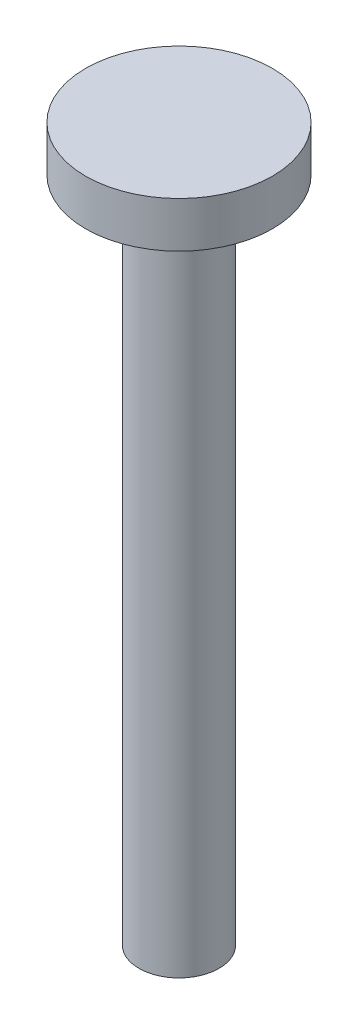
ISO-10303-21;
HEADER;
FILE_DESCRIPTION(('STEP AP214'),'2;1');
FILE_NAME('part.step','',(''),(''),'','','');
FILE_SCHEMA(('AUTOMOTIVE_DESIGN { 1 0 10303 214 1 1 1 1 }'));
ENDSEC;
DATA;
#1=APPLICATION_CONTEXT('core data for automotive mechanical design processes');
#2=APPLICATION_PROTOCOL_DEFINITION('international standard','automotive_design',2000,#1);
#3=PRODUCT_CONTEXT('',#1,'mechanical');
#4=PRODUCT('Part','Part','',(#3));
#5=PRODUCT_RELATED_PRODUCT_CATEGORY('part','',(#4));
#6=PRODUCT_DEFINITION_FORMATION('','',#4);
#7=PRODUCT_DEFINITION_CONTEXT('part definition',#1,'design');
#8=PRODUCT_DEFINITION('design','',#6,#7);
#9=PRODUCT_DEFINITION_SHAPE('','',#8);
#10=(LENGTH_UNIT() NAMED_UNIT(*) SI_UNIT(.MILLI.,.METRE.));
#11=(NAMED_UNIT(*) PLANE_ANGLE_UNIT() SI_UNIT($,.RADIAN.));
#12=(NAMED_UNIT(*) SI_UNIT($,.STERADIAN.) SOLID_ANGLE_UNIT());
#13=UNCERTAINTY_MEASURE_WITH_UNIT(LENGTH_MEASURE(1.E-05),#10,'distance_accuracy_value','');
#14=(GEOMETRIC_REPRESENTATION_CONTEXT(3) GLOBAL_UNCERTAINTY_ASSIGNED_CONTEXT((#13)) GLOBAL_UNIT_ASSIGNED_CONTEXT((#10,
#11,#12)) REPRESENTATION_CONTEXT('',''));
#15=CARTESIAN_POINT('',(0.,0.,0.));
#16=DIRECTION('',(0.,0.,1.));
#17=DIRECTION('',(1.,0.,0.));
#18=AXIS2_PLACEMENT_3D('',#15,#16,#17);
#19=CARTESIAN_POINT('',(0.,1.71,0.));
#20=DIRECTION('',(0.,-1.,0.));
#21=DIRECTION('',(0.,0.,-1.));
#22=AXIS2_PLACEMENT_3D('',#19,#20,#21);
#23=CYLINDRICAL_SURFACE('',#22,3.5);
#24=CARTESIAN_POINT('',(0.,1.71,0.));
#25=DIRECTION('',(0.,1.,0.));
#26=DIRECTION('',(0.,0.,1.));
#27=AXIS2_PLACEMENT_3D('',#24,#25,#26);
#28=CIRCLE('',#27,3.5);
#29=CARTESIAN_POINT('',(0.,1.71,3.5));
#30=VERTEX_POINT('',#29);
#31=EDGE_CURVE('E40',#30,#30,#28,.T.);
#32=ORIENTED_EDGE('',*,*,#31,.F.);
#33=EDGE_LOOP('',(#32));
#34=FACE_BOUND('',#33,.T.);
#35=CARTESIAN_POINT('',(0.,0.,0.));
#36=DIRECTION('',(0.,1.,0.));
#37=DIRECTION('',(0.,0.,1.));
#38=AXIS2_PLACEMENT_3D('',#35,#36,#37);
#39=CIRCLE('',#38,3.5);
#40=CARTESIAN_POINT('',(0.,0.,3.5));
#41=VERTEX_POINT('',#40);
#42=EDGE_CURVE('E36',#41,#41,#39,.T.);
#43=ORIENTED_EDGE('',*,*,#42,.T.);
#44=EDGE_LOOP('',(#43));
#45=FACE_BOUND('',#44,.T.);
#46=ADVANCED_FACE('F33',(#34,#45),#23,.T.);
#47=CARTESIAN_POINT('',(0.,1.71,0.));
#48=DIRECTION('',(0.,1.,0.));
#49=DIRECTION('',(0.,0.,1.));
#50=AXIS2_PLACEMENT_3D('',#47,#48,#49);
#51=PLANE('',#50);
#52=ORIENTED_EDGE('',*,*,#31,.T.);
#53=EDGE_LOOP('',(#52));
#54=FACE_BOUND('',#53,.T.);
#55=ADVANCED_FACE('F57',(#54),#51,.T.);
#56=CARTESIAN_POINT('',(0.,0.,0.));
#57=DIRECTION('',(0.,1.,0.));
#58=DIRECTION('',(0.,0.,1.));
#59=AXIS2_PLACEMENT_3D('',#56,#57,#58);
#60=PLANE('',#59);
#61=CARTESIAN_POINT('',(0.,0.,0.));
#62=DIRECTION('',(0.,-1.,0.));
#63=DIRECTION('',(0.,0.,-1.));
#64=AXIS2_PLACEMENT_3D('',#61,#62,#63);
#65=CIRCLE('',#64,1.5);
#66=CARTESIAN_POINT('',(0.,0.,-1.5));
#67=VERTEX_POINT('',#66);
#68=EDGE_CURVE('E10',#67,#67,#65,.T.);
#69=ORIENTED_EDGE('',*,*,#68,.F.);
#70=EDGE_LOOP('',(#69));
#71=FACE_BOUND('',#70,.T.);
#72=ORIENTED_EDGE('',*,*,#42,.F.);
#73=EDGE_LOOP('',(#72));
#74=FACE_BOUND('',#73,.T.);
#75=ADVANCED_FACE('F54',(#71,#74),#60,.F.);
#76=CARTESIAN_POINT('',(0.,-25.,0.));
#77=DIRECTION('',(0.,1.,0.));
#78=DIRECTION('',(0.,0.,1.));
#79=AXIS2_PLACEMENT_3D('',#76,#77,#78);
#80=CYLINDRICAL_SURFACE('',#79,1.5);
#81=CARTESIAN_POINT('',(0.,-25.,0.));
#82=DIRECTION('',(0.,-1.,0.));
#83=DIRECTION('',(0.,0.,-1.));
#84=AXIS2_PLACEMENT_3D('',#81,#82,#83);
#85=CIRCLE('',#84,1.5);
#86=CARTESIAN_POINT('',(0.,-25.,-1.5));
#87=VERTEX_POINT('',#86);
#88=EDGE_CURVE('E46',#87,#87,#85,.T.);
#89=ORIENTED_EDGE('',*,*,#88,.F.);
#90=EDGE_LOOP('',(#89));
#91=FACE_BOUND('',#90,.T.);
#92=ORIENTED_EDGE('',*,*,#68,.T.);
#93=EDGE_LOOP('',(#92));
#94=FACE_BOUND('',#93,.T.);
#95=ADVANCED_FACE('F56',(#91,#94),#80,.T.);
#96=CARTESIAN_POINT('',(0.,-25.,0.));
#97=DIRECTION('',(0.,-1.,0.));
#98=DIRECTION('',(0.,0.,-1.));
#99=AXIS2_PLACEMENT_3D('',#96,#97,#98);
#100=PLANE('',#99);
#101=ORIENTED_EDGE('',*,*,#88,.T.);
#102=EDGE_LOOP('',(#101));
#103=FACE_BOUND('',#102,.T.);
#104=ADVANCED_FACE('F63',(#103),#100,.T.);
#105=CLOSED_SHELL('',(#46,#55,#75,#95,#104));
#106=MANIFOLD_SOLID_BREP('B2',#105);
#107=ADVANCED_BREP_SHAPE_REPRESENTATION('',(#18,#106),#14);
#108=SHAPE_DEFINITION_REPRESENTATION(#9,#107);
ENDSEC;
END-ISO-10303-21;
